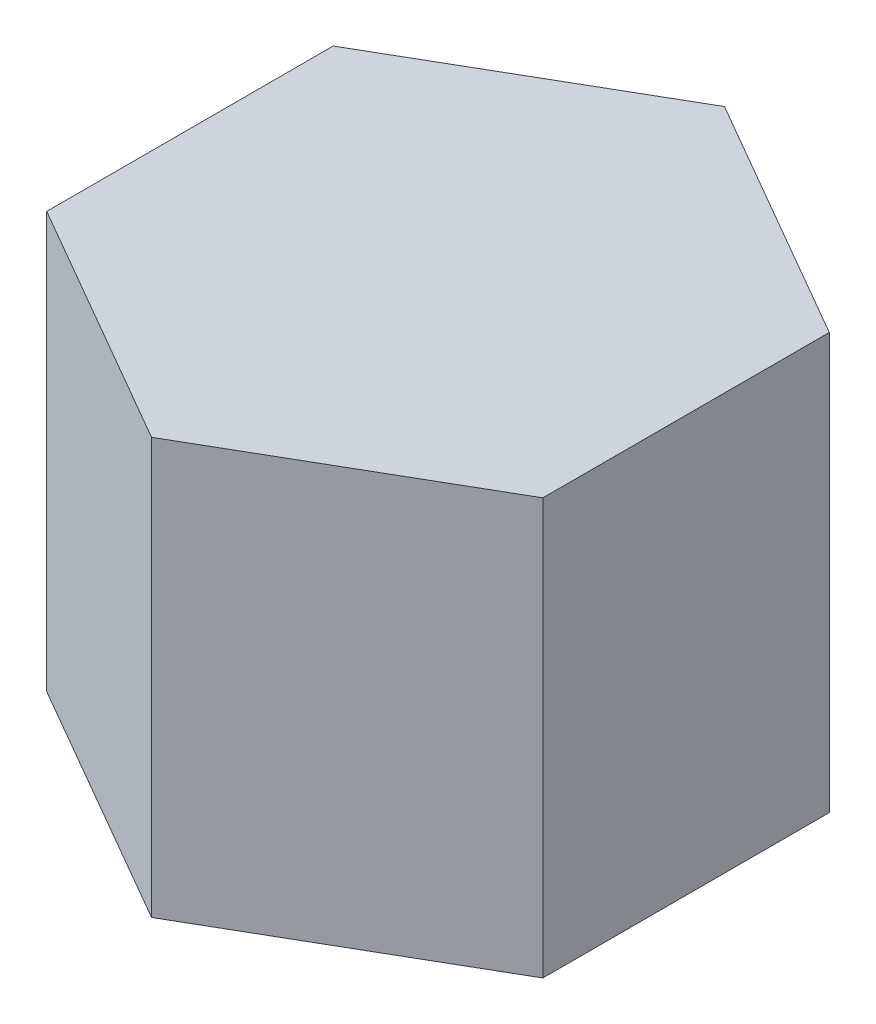
ISO-10303-21;
HEADER;
FILE_DESCRIPTION(('STEP AP214'),'2;1');
FILE_NAME('part.step','',(''),(''),'','','');
FILE_SCHEMA(('AUTOMOTIVE_DESIGN { 1 0 10303 214 1 1 1 1 }'));
ENDSEC;
DATA;
#1=APPLICATION_CONTEXT('core data for automotive mechanical design processes');
#2=APPLICATION_PROTOCOL_DEFINITION('international standard','automotive_design',2000,#1);
#3=PRODUCT_CONTEXT('',#1,'mechanical');
#4=PRODUCT('Part','Part','',(#3));
#5=PRODUCT_RELATED_PRODUCT_CATEGORY('part','',(#4));
#6=PRODUCT_DEFINITION_FORMATION('','',#4);
#7=PRODUCT_DEFINITION_CONTEXT('part definition',#1,'design');
#8=PRODUCT_DEFINITION('design','',#6,#7);
#9=PRODUCT_DEFINITION_SHAPE('','',#8);
#10=(LENGTH_UNIT() NAMED_UNIT(*) SI_UNIT(.MILLI.,.METRE.));
#11=(NAMED_UNIT(*) PLANE_ANGLE_UNIT() SI_UNIT($,.RADIAN.));
#12=(NAMED_UNIT(*) SI_UNIT($,.STERADIAN.) SOLID_ANGLE_UNIT());
#13=UNCERTAINTY_MEASURE_WITH_UNIT(LENGTH_MEASURE(1.E-05),#10,'distance_accuracy_value','');
#14=(GEOMETRIC_REPRESENTATION_CONTEXT(3) GLOBAL_UNCERTAINTY_ASSIGNED_CONTEXT((#13)) GLOBAL_UNIT_ASSIGNED_CONTEXT((#10,
#11,#12)) REPRESENTATION_CONTEXT('',''));
#15=CARTESIAN_POINT('',(0.,0.,0.));
#16=DIRECTION('',(0.,0.,1.));
#17=DIRECTION('',(1.,0.,0.));
#18=AXIS2_PLACEMENT_3D('',#15,#16,#17);
#19=CARTESIAN_POINT('',(202.142660308706,-148.537700895744,292.372996624279));
#20=DIRECTION('',(-0.500000000000028,0.,-0.866025403784423));
#21=DIRECTION('',(-0.866025403784423,0.,0.500000000000028));
#22=AXIS2_PLACEMENT_3D('',#19,#20,#21);
#23=PLANE('',#22);
#24=CARTESIAN_POINT('',(201.839551417382,-149.045793579175,292.547996624279));
#25=DIRECTION('',(0.866025403784422,0.,-0.500000000000028));
#26=VECTOR('',#25,1.);
#27=LINE('',#24,#26);
#28=CARTESIAN_POINT('',(201.839551417382,-149.045793579175,292.547996624279));
#29=VERTEX_POINT('',#28);
#30=CARTESIAN_POINT('',(202.142660308706,-149.045793579175,292.372996624279));
#31=VERTEX_POINT('',#30);
#32=EDGE_CURVE('E170',#29,#31,#27,.T.);
#33=ORIENTED_EDGE('',*,*,#32,.T.);
#34=CARTESIAN_POINT('',(202.142660308706,-148.537700895744,292.372996624279));
#35=DIRECTION('',(0.,-1.,0.));
#36=VECTOR('',#35,1.);
#37=LINE('',#34,#36);
#38=CARTESIAN_POINT('',(202.142660308706,-148.537700895744,292.372996624279));
#39=VERTEX_POINT('',#38);
#40=EDGE_CURVE('E35',#39,#31,#37,.T.);
#41=ORIENTED_EDGE('',*,*,#40,.F.);
#42=CARTESIAN_POINT('',(201.839551417382,-148.537700895744,292.547996624279));
#43=DIRECTION('',(0.866025403784422,0.,-0.500000000000028));
#44=VECTOR('',#43,1.);
#45=LINE('',#42,#44);
#46=CARTESIAN_POINT('',(201.839551417382,-148.537700895744,292.547996624279));
#47=VERTEX_POINT('',#46);
#48=EDGE_CURVE('E159',#47,#39,#45,.T.);
#49=ORIENTED_EDGE('',*,*,#48,.F.);
#50=CARTESIAN_POINT('',(201.839551417382,-148.537700895744,292.547996624279));
#51=DIRECTION('',(0.,-1.,0.));
#52=VECTOR('',#51,1.);
#53=LINE('',#50,#52);
#54=EDGE_CURVE('E10',#47,#29,#53,.T.);
#55=ORIENTED_EDGE('',*,*,#54,.T.);
#56=EDGE_LOOP('',(#33,#41,#49,#55));
#57=FACE_BOUND('',#56,.T.);
#58=ADVANCED_FACE('F16',(#57),#23,.F.);
#59=CARTESIAN_POINT('',(201.839551417382,-148.537700895744,292.547996624279));
#60=DIRECTION('',(0.499999999999978,0.,-0.866025403784452));
#61=DIRECTION('',(-0.866025403784452,0.,-0.499999999999978));
#62=AXIS2_PLACEMENT_3D('',#59,#60,#61);
#63=PLANE('',#62);
#64=CARTESIAN_POINT('',(201.536442526057,-149.045793579175,292.372996624279));
#65=DIRECTION('',(0.866025403784452,0.,0.499999999999978));
#66=VECTOR('',#65,1.);
#67=LINE('',#64,#66);
#68=CARTESIAN_POINT('',(201.536442526057,-149.045793579175,292.372996624279));
#69=VERTEX_POINT('',#68);
#70=EDGE_CURVE('E167',#69,#29,#67,.T.);
#71=ORIENTED_EDGE('',*,*,#70,.T.);
#72=ORIENTED_EDGE('',*,*,#54,.F.);
#73=CARTESIAN_POINT('',(201.536442526057,-148.537700895744,292.372996624279));
#74=DIRECTION('',(0.866025403784452,0.,0.499999999999978));
#75=VECTOR('',#74,1.);
#76=LINE('',#73,#75);
#77=CARTESIAN_POINT('',(201.536442526057,-148.537700895744,292.372996624279));
#78=VERTEX_POINT('',#77);
#79=EDGE_CURVE('E156',#78,#47,#76,.T.);
#80=ORIENTED_EDGE('',*,*,#79,.F.);
#81=CARTESIAN_POINT('',(201.536442526057,-148.537700895744,292.372996624279));
#82=DIRECTION('',(0.,-1.,0.));
#83=VECTOR('',#82,1.);
#84=LINE('',#81,#83);
#85=EDGE_CURVE('E27',#78,#69,#84,.T.);
#86=ORIENTED_EDGE('',*,*,#85,.T.);
#87=EDGE_LOOP('',(#71,#72,#80,#86));
#88=FACE_BOUND('',#87,.T.);
#89=ADVANCED_FACE('F189',(#88),#63,.F.);
#90=CARTESIAN_POINT('',(201.536442526057,-148.537700895744,290.831971220494));
#91=DIRECTION('',(1.,0.,0.));
#92=DIRECTION('',(0.,1.,0.));
#93=AXIS2_PLACEMENT_3D('',#90,#91,#92);
#94=PLANE('',#93);
#95=CARTESIAN_POINT('',(201.536442526057,-149.045793579175,292.022996624279));
#96=DIRECTION('',(0.,0.,1.));
#97=VECTOR('',#96,1.);
#98=LINE('',#95,#97);
#99=CARTESIAN_POINT('',(201.536442526057,-149.045793579175,292.022996624279));
#100=VERTEX_POINT('',#99);
#101=EDGE_CURVE('E163',#100,#69,#98,.T.);
#102=ORIENTED_EDGE('',*,*,#101,.T.);
#103=ORIENTED_EDGE('',*,*,#85,.F.);
#104=CARTESIAN_POINT('',(201.536442526057,-148.537700895744,292.022996624279));
#105=DIRECTION('',(0.,0.,1.));
#106=VECTOR('',#105,1.);
#107=LINE('',#104,#106);
#108=CARTESIAN_POINT('',(201.536442526057,-148.537700895744,292.022996624279));
#109=VERTEX_POINT('',#108);
#110=EDGE_CURVE('E106',#109,#78,#107,.T.);
#111=ORIENTED_EDGE('',*,*,#110,.F.);
#112=CARTESIAN_POINT('',(201.536442526057,-148.537700895744,292.022996624279));
#113=DIRECTION('',(0.,-1.,0.));
#114=VECTOR('',#113,1.);
#115=LINE('',#112,#114);
#116=EDGE_CURVE('E94',#109,#100,#115,.T.);
#117=ORIENTED_EDGE('',*,*,#116,.T.);
#118=EDGE_LOOP('',(#102,#103,#111,#117));
#119=FACE_BOUND('',#118,.T.);
#120=ADVANCED_FACE('F198',(#119),#94,.F.);
#121=CARTESIAN_POINT('',(201.536442526057,-148.537700895744,292.022996624279));
#122=DIRECTION('',(0.499999999999943,0.,0.866025403784472));
#123=DIRECTION('',(0.866025403784472,0.,-0.499999999999943));
#124=AXIS2_PLACEMENT_3D('',#121,#122,#123);
#125=PLANE('',#124);
#126=CARTESIAN_POINT('',(201.839551417382,-149.045793579175,291.847996624279));
#127=DIRECTION('',(-0.866025403784471,0.,0.499999999999943));
#128=VECTOR('',#127,1.);
#129=LINE('',#126,#128);
#130=CARTESIAN_POINT('',(201.839551417382,-149.045793579175,291.847996624279));
#131=VERTEX_POINT('',#130);
#132=EDGE_CURVE('E162',#131,#100,#129,.T.);
#133=ORIENTED_EDGE('',*,*,#132,.T.);
#134=ORIENTED_EDGE('',*,*,#116,.F.);
#135=CARTESIAN_POINT('',(201.839551417382,-148.537700895744,291.847996624279));
#136=DIRECTION('',(-0.866025403784471,0.,0.499999999999943));
#137=VECTOR('',#136,1.);
#138=LINE('',#135,#137);
#139=CARTESIAN_POINT('',(201.839551417382,-148.537700895744,291.847996624279));
#140=VERTEX_POINT('',#139);
#141=EDGE_CURVE('E98',#140,#109,#138,.T.);
#142=ORIENTED_EDGE('',*,*,#141,.F.);
#143=CARTESIAN_POINT('',(201.839551417382,-148.537700895744,291.847996624279));
#144=DIRECTION('',(0.,-1.,0.));
#145=VECTOR('',#144,1.);
#146=LINE('',#143,#145);
#147=EDGE_CURVE('E79',#140,#131,#146,.T.);
#148=ORIENTED_EDGE('',*,*,#147,.T.);
#149=EDGE_LOOP('',(#133,#134,#142,#148));
#150=FACE_BOUND('',#149,.T.);
#151=ADVANCED_FACE('F100',(#150),#125,.F.);
#152=CARTESIAN_POINT('',(201.839551417381,-148.537700895744,291.847996624279));
#153=DIRECTION('',(-0.500000000000028,0.,0.866025403784423));
#154=DIRECTION('',(0.866025403784423,0.,0.500000000000028));
#155=AXIS2_PLACEMENT_3D('',#152,#153,#154);
#156=PLANE('',#155);
#157=CARTESIAN_POINT('',(202.142660308706,-149.045793579175,292.022996624279));
#158=DIRECTION('',(-0.866025403784422,0.,-0.500000000000028));
#159=VECTOR('',#158,1.);
#160=LINE('',#157,#159);
#161=CARTESIAN_POINT('',(202.142660308706,-149.045793579175,292.022996624279));
#162=VERTEX_POINT('',#161);
#163=EDGE_CURVE('E88',#162,#131,#160,.T.);
#164=ORIENTED_EDGE('',*,*,#163,.T.);
#165=ORIENTED_EDGE('',*,*,#147,.F.);
#166=CARTESIAN_POINT('',(202.142660308706,-148.537700895744,292.022996624279));
#167=DIRECTION('',(-0.866025403784422,0.,-0.500000000000028));
#168=VECTOR('',#167,1.);
#169=LINE('',#166,#168);
#170=CARTESIAN_POINT('',(202.142660308706,-148.537700895744,292.022996624279));
#171=VERTEX_POINT('',#170);
#172=EDGE_CURVE('E84',#171,#140,#169,.T.);
#173=ORIENTED_EDGE('',*,*,#172,.F.);
#174=CARTESIAN_POINT('',(202.142660308706,-148.537700895744,292.022996624279));
#175=DIRECTION('',(0.,-1.,0.));
#176=VECTOR('',#175,1.);
#177=LINE('',#174,#176);
#178=EDGE_CURVE('E58',#171,#162,#177,.T.);
#179=ORIENTED_EDGE('',*,*,#178,.T.);
#180=EDGE_LOOP('',(#164,#165,#173,#179));
#181=FACE_BOUND('',#180,.T.);
#182=ADVANCED_FACE('F82',(#181),#156,.F.);
#183=CARTESIAN_POINT('',(202.142660308706,-148.537700895744,290.831971220494));
#184=DIRECTION('',(-1.,0.,0.));
#185=DIRECTION('',(0.,-1.,0.));
#186=AXIS2_PLACEMENT_3D('',#183,#184,#185);
#187=PLANE('',#186);
#188=CARTESIAN_POINT('',(202.142660308706,-149.045793579175,292.372996624279));
#189=DIRECTION('',(0.,0.,-1.));
#190=VECTOR('',#189,1.);
#191=LINE('',#188,#190);
#192=EDGE_CURVE('E160',#31,#162,#191,.T.);
#193=ORIENTED_EDGE('',*,*,#192,.T.);
#194=ORIENTED_EDGE('',*,*,#178,.F.);
#195=CARTESIAN_POINT('',(202.142660308706,-148.537700895744,292.372996624279));
#196=DIRECTION('',(0.,0.,-1.));
#197=VECTOR('',#196,1.);
#198=LINE('',#195,#197);
#199=EDGE_CURVE('E112',#39,#171,#198,.T.);
#200=ORIENTED_EDGE('',*,*,#199,.F.);
#201=ORIENTED_EDGE('',*,*,#40,.T.);
#202=EDGE_LOOP('',(#193,#194,#200,#201));
#203=FACE_BOUND('',#202,.T.);
#204=ADVANCED_FACE('F131',(#203),#187,.F.);
#205=CARTESIAN_POINT('',(206.339551417382,-148.537700895744,290.831971220494));
#206=DIRECTION('',(0.,-1.,0.));
#207=DIRECTION('',(1.,0.,0.));
#208=AXIS2_PLACEMENT_3D('',#205,#206,#207);
#209=PLANE('',#208);
#210=ORIENTED_EDGE('',*,*,#48,.T.);
#211=ORIENTED_EDGE('',*,*,#199,.T.);
#212=ORIENTED_EDGE('',*,*,#172,.T.);
#213=ORIENTED_EDGE('',*,*,#141,.T.);
#214=ORIENTED_EDGE('',*,*,#110,.T.);
#215=ORIENTED_EDGE('',*,*,#79,.T.);
#216=EDGE_LOOP('',(#210,#211,#212,#213,#214,#215));
#217=FACE_BOUND('',#216,.T.);
#218=ADVANCED_FACE('F111',(#217),#209,.F.);
#219=CARTESIAN_POINT('',(206.339551417382,-149.045793579175,290.831971220494));
#220=DIRECTION('',(0.,-1.,0.));
#221=DIRECTION('',(1.,0.,0.));
#222=AXIS2_PLACEMENT_3D('',#219,#220,#221);
#223=PLANE('',#222);
#224=ORIENTED_EDGE('',*,*,#32,.F.);
#225=ORIENTED_EDGE('',*,*,#70,.F.);
#226=ORIENTED_EDGE('',*,*,#101,.F.);
#227=ORIENTED_EDGE('',*,*,#132,.F.);
#228=ORIENTED_EDGE('',*,*,#163,.F.);
#229=ORIENTED_EDGE('',*,*,#192,.F.);
#230=EDGE_LOOP('',(#224,#225,#226,#227,#228,#229));
#231=FACE_BOUND('',#230,.T.);
#232=ADVANCED_FACE('F130',(#231),#223,.T.);
#233=CLOSED_SHELL('',(#58,#89,#120,#151,#182,#204,#218,#232));
#234=MANIFOLD_SOLID_BREP('B1',#233);
#235=ADVANCED_BREP_SHAPE_REPRESENTATION('',(#18,#234),#14);
#236=SHAPE_DEFINITION_REPRESENTATION(#9,#235);
ENDSEC;
END-ISO-10303-21;
